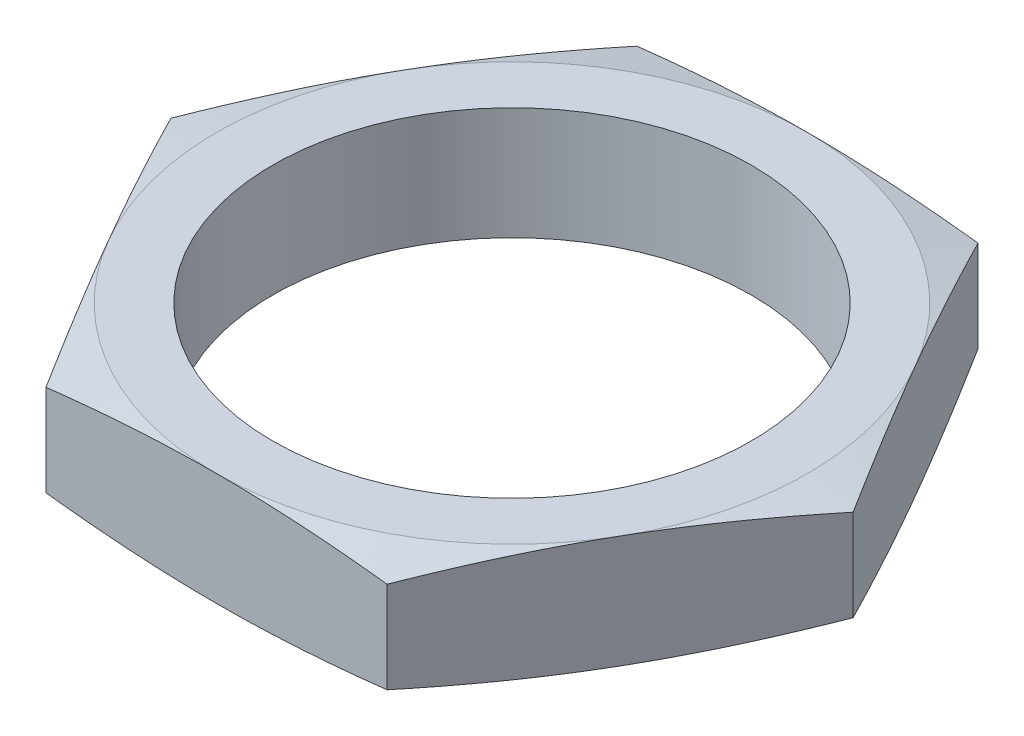
ISO-10303-21;
HEADER;
FILE_DESCRIPTION(('STEP AP214'),'2;1');
FILE_NAME('part.step','',(''),(''),'','','');
FILE_SCHEMA(('AUTOMOTIVE_DESIGN { 1 0 10303 214 1 1 1 1 }'));
ENDSEC;
DATA;
#1=APPLICATION_CONTEXT('core data for automotive mechanical design processes');
#2=APPLICATION_PROTOCOL_DEFINITION('international standard','automotive_design',2000,#1);
#3=PRODUCT_CONTEXT('',#1,'mechanical');
#4=PRODUCT('Part','Part','',(#3));
#5=PRODUCT_RELATED_PRODUCT_CATEGORY('part','',(#4));
#6=PRODUCT_DEFINITION_FORMATION('','',#4);
#7=PRODUCT_DEFINITION_CONTEXT('part definition',#1,'design');
#8=PRODUCT_DEFINITION('design','',#6,#7);
#9=PRODUCT_DEFINITION_SHAPE('','',#8);
#10=(LENGTH_UNIT() NAMED_UNIT(*) SI_UNIT(.MILLI.,.METRE.));
#11=(NAMED_UNIT(*) PLANE_ANGLE_UNIT() SI_UNIT($,.RADIAN.));
#12=(NAMED_UNIT(*) SI_UNIT($,.STERADIAN.) SOLID_ANGLE_UNIT());
#13=UNCERTAINTY_MEASURE_WITH_UNIT(LENGTH_MEASURE(1.E-05),#10,'distance_accuracy_value','');
#14=(GEOMETRIC_REPRESENTATION_CONTEXT(3) GLOBAL_UNCERTAINTY_ASSIGNED_CONTEXT((#13)) GLOBAL_UNIT_ASSIGNED_CONTEXT((#10,
#11,#12)) REPRESENTATION_CONTEXT('',''));
#15=CARTESIAN_POINT('',(0.,0.,0.));
#16=DIRECTION('',(0.,0.,1.));
#17=DIRECTION('',(1.,0.,0.));
#18=AXIS2_PLACEMENT_3D('',#15,#16,#17);
#19=CARTESIAN_POINT('',(6.06217782649107,4.,10.5));
#20=DIRECTION('',(-0.866025403784439,0.,-0.5));
#21=DIRECTION('',(-0.5,0.,0.866025403784439));
#22=AXIS2_PLACEMENT_3D('',#19,#20,#21);
#23=PLANE('',#22);
#24=CARTESIAN_POINT('',(12.124471123036,0.375038710091855,-0.000200000000003287));
#25=CARTESIAN_POINT('',(11.8724989067043,0.316841888937931,0.436228680782173));
#26=CARTESIAN_POINT('',(11.6201860460254,0.264041816028018,0.873247374881132));
#27=CARTESIAN_POINT('',(11.1148984011924,0.171316417791879,1.7484312481686));
#28=CARTESIAN_POINT('',(10.8619234426667,0.131394921849064,2.18659672937783));
#29=CARTESIAN_POINT('',(10.3564530180006,0.0666694911329807,3.06209718662287));
#30=CARTESIAN_POINT('',(10.1039594400735,0.0418081017252033,3.49942889217747));
#31=CARTESIAN_POINT('',(9.59873279539913,0.00847451473004502,4.37450711009106));
#32=CARTESIAN_POINT('',(9.34599976756787,0.,4.81225355504553));
#33=CARTESIAN_POINT('',(8.84053371190534,0.,5.68774644495447));
#34=CARTESIAN_POINT('',(8.58780068407407,0.00847451473004509,6.12549288990895));
#35=CARTESIAN_POINT('',(8.08257403939968,0.0418081017252037,7.00057110782253));
#36=CARTESIAN_POINT('',(7.83008046147258,0.0666694911329814,7.43790281337713));
#37=CARTESIAN_POINT('',(7.32461003680651,0.131394921849065,8.31340327062217));
#38=CARTESIAN_POINT('',(7.07163507828076,0.17131641779188,8.7515687518314));
#39=CARTESIAN_POINT('',(6.56634743344782,0.264041816028019,9.62675262511887));
#40=CARTESIAN_POINT('',(6.31403457276889,0.316841888937933,10.0637713192178));
#41=CARTESIAN_POINT('',(6.06206235643723,0.375038710091857,10.5002));
#42=B_SPLINE_CURVE_WITH_KNOTS('',3,(#24,#25,#26,#27,#28,#29,#30,#31,#32,#33,#34,#35,#36,#37,#38,
#39,#40,#41),.UNSPECIFIED.,.F.,.F.,(4,2,2,2,2,2,2,2,4),(0.,1.52193893076381,3.04432998658017,
4.56087589681654,6.07720734820422,7.59353879959189,9.11008470982826,10.6324757656446,
12.1544146964084),.UNSPECIFIED.);
#43=CARTESIAN_POINT('',(12.1243556529821,0.375012051348566,0.));
#44=VERTEX_POINT('',#43);
#45=CARTESIAN_POINT('',(9.09326673973661,0.,5.25));
#46=VERTEX_POINT('',#45);
#47=EDGE_CURVE('E49',#44,#46,#42,.T.);
#48=ORIENTED_EDGE('',*,*,#47,.F.);
#49=DIRECTION('',(0.,-1.,0.));
#50=VECTOR('',#49,1.);
#51=CARTESIAN_POINT('',(12.1243556529821,4.,0.));
#52=LINE('',#51,#50);
#53=CARTESIAN_POINT('',(12.1243556529821,3.62498794865143,0.));
#54=VERTEX_POINT('',#53);
#55=EDGE_CURVE('E165',#54,#44,#52,.T.);
#56=ORIENTED_EDGE('',*,*,#55,.F.);
#57=CARTESIAN_POINT('',(6.06206235643723,3.62496128990814,10.5002));
#58=CARTESIAN_POINT('',(6.31403457276889,3.68315811106207,10.0637713192178));
#59=CARTESIAN_POINT('',(6.56634743344783,3.73595818397198,9.62675262511887));
#60=CARTESIAN_POINT('',(7.07163507828076,3.82868358220812,8.7515687518314));
#61=CARTESIAN_POINT('',(7.32461003680651,3.86860507815093,8.31340327062217));
#62=CARTESIAN_POINT('',(7.83008046147258,3.93333050886702,7.43790281337713));
#63=CARTESIAN_POINT('',(8.08257403939968,3.9581918982748,7.00057110782253));
#64=CARTESIAN_POINT('',(8.58780068407407,3.99152548526995,6.12549288990895));
#65=CARTESIAN_POINT('',(8.84053371190534,4.,5.68774644495447));
#66=CARTESIAN_POINT('',(9.34599976756787,4.,4.81225355504553));
#67=CARTESIAN_POINT('',(9.59873279539913,3.99152548526995,4.37450711009106));
#68=CARTESIAN_POINT('',(10.1039594400735,3.9581918982748,3.49942889217747));
#69=CARTESIAN_POINT('',(10.3564530180006,3.93333050886702,3.06209718662287));
#70=CARTESIAN_POINT('',(10.8619234426667,3.86860507815094,2.18659672937783));
#71=CARTESIAN_POINT('',(11.1148984011924,3.82868358220812,1.7484312481686));
#72=CARTESIAN_POINT('',(11.6201860460254,3.73595818397198,0.873247374881133));
#73=CARTESIAN_POINT('',(11.8724989067043,3.68315811106207,0.436228680782172));
#74=CARTESIAN_POINT('',(12.124471123036,3.62496128990814,-0.000200000000005463));
#75=B_SPLINE_CURVE_WITH_KNOTS('',3,(#57,#58,#59,#60,#61,#62,#63,#64,#65,#66,#67,#68,#69,#70,#71,
#72,#73,#74),.UNSPECIFIED.,.F.,.F.,(4,2,2,2,2,2,2,2,4),(0.,1.52193893076381,3.04432998658017,
4.56087589681654,6.07720734820422,7.59353879959189,9.11008470982826,10.6324757656446,
12.1544146964084),.UNSPECIFIED.);
#76=CARTESIAN_POINT('',(9.0932667397366,4.,5.25));
#77=VERTEX_POINT('',#76);
#78=EDGE_CURVE('E191',#77,#54,#75,.T.);
#79=ORIENTED_EDGE('',*,*,#78,.F.);
#80=CARTESIAN_POINT('',(6.06217782649107,3.62498794865143,10.5));
#81=VERTEX_POINT('',#80);
#82=EDGE_CURVE('E318',#81,#77,#75,.T.);
#83=ORIENTED_EDGE('',*,*,#82,.F.);
#84=DIRECTION('',(0.,-1.,0.));
#85=VECTOR('',#84,1.);
#86=CARTESIAN_POINT('',(6.06217782649107,4.,10.5));
#87=LINE('',#86,#85);
#88=CARTESIAN_POINT('',(6.06217782649107,0.375012051348568,10.5));
#89=VERTEX_POINT('',#88);
#90=EDGE_CURVE('E151',#81,#89,#87,.T.);
#91=ORIENTED_EDGE('',*,*,#90,.T.);
#92=EDGE_CURVE('E144',#46,#89,#42,.T.);
#93=ORIENTED_EDGE('',*,*,#92,.F.);
#94=EDGE_LOOP('',(#48,#56,#79,#83,#91,#93));
#95=FACE_BOUND('',#94,.T.);
#96=ADVANCED_FACE('F33',(#95),#23,.F.);
#97=CARTESIAN_POINT('',(12.1243556529821,4.,0.));
#98=DIRECTION('',(-0.866025403784439,0.,0.5));
#99=DIRECTION('',(0.5,0.,0.866025403784439));
#100=AXIS2_PLACEMENT_3D('',#97,#98,#99);
#101=PLANE('',#100);
#102=CARTESIAN_POINT('',(6.06206235643723,0.375038710091857,-10.5002));
#103=CARTESIAN_POINT('',(6.31403457276889,0.316841888937933,-10.0637713192178));
#104=CARTESIAN_POINT('',(6.56634743344782,0.264041816028019,-9.62675262511887));
#105=CARTESIAN_POINT('',(7.07163507828076,0.17131641779188,-8.7515687518314));
#106=CARTESIAN_POINT('',(7.32461003680651,0.131394921849065,-8.31340327062217));
#107=CARTESIAN_POINT('',(7.83008046147258,0.0666694911329814,-7.43790281337713));
#108=CARTESIAN_POINT('',(8.08257403939968,0.041808101725204,-7.00057110782253));
#109=CARTESIAN_POINT('',(8.58780068407407,0.00847451473004552,-6.12549288990895));
#110=CARTESIAN_POINT('',(8.84053371190534,0.,-5.68774644495448));
#111=CARTESIAN_POINT('',(9.34599976756787,0.,-4.81225355504553));
#112=CARTESIAN_POINT('',(9.59873279539913,0.00847451473004533,-4.37450711009106));
#113=CARTESIAN_POINT('',(10.1039594400735,0.0418081017252036,-3.49942889217748));
#114=CARTESIAN_POINT('',(10.3564530180006,0.0666694911329808,-3.06209718662288));
#115=CARTESIAN_POINT('',(10.8619234426667,0.131394921849064,-2.18659672937783));
#116=CARTESIAN_POINT('',(11.1148984011924,0.171316417791879,-1.74843124816861));
#117=CARTESIAN_POINT('',(11.6201860460254,0.264041816028018,-0.873247374881138));
#118=CARTESIAN_POINT('',(11.8724989067043,0.316841888937931,-0.436228680782177));
#119=CARTESIAN_POINT('',(12.124471123036,0.375038710091855,0.000199999999998464));
#120=B_SPLINE_CURVE_WITH_KNOTS('',3,(#102,#103,#104,#105,#106,#107,#108,#109,#110,#111,#112,
#113,#114,#115,#116,#117,#118,#119),.UNSPECIFIED.,.F.,.F.,(4,2,2,2,2,2,2,2,4),(0.,
1.52193893076381,3.04432998658017,4.56087589681654,6.07720734820421,7.59353879959189,
9.11008470982826,10.6324757656446,12.1544146964084),.UNSPECIFIED.);
#121=CARTESIAN_POINT('',(6.06217782649107,0.375012051348568,-10.5));
#122=VERTEX_POINT('',#121);
#123=CARTESIAN_POINT('',(9.09326673973661,0.,-5.25));
#124=VERTEX_POINT('',#123);
#125=EDGE_CURVE('E56',#122,#124,#120,.T.);
#126=ORIENTED_EDGE('',*,*,#125,.F.);
#127=DIRECTION('',(0.,-1.,0.));
#128=VECTOR('',#127,1.);
#129=CARTESIAN_POINT('',(6.06217782649107,4.,-10.5));
#130=LINE('',#129,#128);
#131=CARTESIAN_POINT('',(6.06217782649107,3.62498794865143,-10.5));
#132=VERTEX_POINT('',#131);
#133=EDGE_CURVE('E162',#132,#122,#130,.T.);
#134=ORIENTED_EDGE('',*,*,#133,.F.);
#135=CARTESIAN_POINT('',(12.124471123036,3.62496128990814,0.000199999999996775));
#136=CARTESIAN_POINT('',(11.8724989067043,3.68315811106207,-0.436228680782181));
#137=CARTESIAN_POINT('',(11.6201860460254,3.73595818397198,-0.873247374881141));
#138=CARTESIAN_POINT('',(11.1148984011924,3.82868358220812,-1.74843124816861));
#139=CARTESIAN_POINT('',(10.8619234426667,3.86860507815094,-2.18659672937784));
#140=CARTESIAN_POINT('',(10.3564530180006,3.93333050886702,-3.06209718662288));
#141=CARTESIAN_POINT('',(10.1039594400735,3.9581918982748,-3.49942889217748));
#142=CARTESIAN_POINT('',(9.59873279539913,3.99152548526995,-4.37450711009106));
#143=CARTESIAN_POINT('',(9.34599976756787,4.,-4.81225355504553));
#144=CARTESIAN_POINT('',(8.84053371190533,4.,-5.68774644495448));
#145=CARTESIAN_POINT('',(8.58780068407407,3.99152548526995,-6.12549288990895));
#146=CARTESIAN_POINT('',(8.08257403939968,3.95819189827479,-7.00057110782253));
#147=CARTESIAN_POINT('',(7.83008046147258,3.93333050886702,-7.43790281337713));
#148=CARTESIAN_POINT('',(7.32461003680651,3.86860507815093,-8.31340327062217));
#149=CARTESIAN_POINT('',(7.07163507828076,3.82868358220812,-8.7515687518314));
#150=CARTESIAN_POINT('',(6.56634743344782,3.73595818397198,-9.62675262511887));
#151=CARTESIAN_POINT('',(6.31403457276889,3.68315811106207,-10.0637713192178));
#152=CARTESIAN_POINT('',(6.06206235643723,3.62496128990814,-10.5002));
#153=B_SPLINE_CURVE_WITH_KNOTS('',3,(#135,#136,#137,#138,#139,#140,#141,#142,#143,#144,#145,
#146,#147,#148,#149,#150,#151,#152),.UNSPECIFIED.,.F.,.F.,(4,2,2,2,2,2,2,2,4),(0.,
1.52193893076381,3.04432998658017,4.56087589681654,6.07720734820421,7.59353879959189,
9.11008470982826,10.6324757656446,12.1544146964084),.UNSPECIFIED.);
#154=CARTESIAN_POINT('',(9.0932667397366,4.,-5.25));
#155=VERTEX_POINT('',#154);
#156=EDGE_CURVE('E220',#155,#132,#153,.T.);
#157=ORIENTED_EDGE('',*,*,#156,.F.);
#158=EDGE_CURVE('E316',#54,#155,#153,.T.);
#159=ORIENTED_EDGE('',*,*,#158,.F.);
#160=ORIENTED_EDGE('',*,*,#55,.T.);
#161=EDGE_CURVE('E241',#124,#44,#120,.T.);
#162=ORIENTED_EDGE('',*,*,#161,.F.);
#163=EDGE_LOOP('',(#126,#134,#157,#159,#160,#162));
#164=FACE_BOUND('',#163,.T.);
#165=ADVANCED_FACE('F228',(#164),#101,.F.);
#166=CARTESIAN_POINT('',(6.06217782649107,4.,-10.5));
#167=DIRECTION('',(0.,0.,1.));
#168=DIRECTION('',(1.,0.,0.));
#169=AXIS2_PLACEMENT_3D('',#166,#167,#168);
#170=PLANE('',#169);
#171=CARTESIAN_POINT('',(-16.2466371343311,2.04187515521451,-10.5));
#172=CARTESIAN_POINT('',(-15.7675131443876,1.94899793660242,-10.5));
#173=CARTESIAN_POINT('',(-15.288167910323,1.85724226812233,-10.5));
#174=CARTESIAN_POINT('',(-14.3289270333188,1.67657467185462,-10.5));
#175=CARTESIAN_POINT('',(-13.8490313737509,1.58766283245538,-10.5));
#176=CARTESIAN_POINT('',(-12.888288556212,1.41323074983288,-10.5));
#177=CARTESIAN_POINT('',(-12.407440975413,1.32771282745212,-10.5));
#178=CARTESIAN_POINT('',(-11.4450073984572,1.16094054868653,-10.5));
#179=CARTESIAN_POINT('',(-10.9634214067909,1.07968616647894,-10.5));
#180=CARTESIAN_POINT('',(-10.0023298306602,0.92292849403781,-10.5));
#181=CARTESIAN_POINT('',(-9.52282950637869,0.847393106967713,-10.5));
#182=CARTESIAN_POINT('',(-8.56285972857042,0.702765717999945,-10.5));
#183=CARTESIAN_POINT('',(-8.08239029054423,0.633673613866191,-10.5));
#184=CARTESIAN_POINT('',(-7.12039491812431,0.503437062967873,-10.5));
#185=CARTESIAN_POINT('',(-6.63886904694564,0.442292153173562,-10.5));
#186=CARTESIAN_POINT('',(-5.67467247766544,0.329697737760834,-10.5));
#187=CARTESIAN_POINT('',(-5.19200177878774,0.278248238717723,-10.5));
#188=CARTESIAN_POINT('',(-4.2214778666045,0.186566771843328,-10.5));
#189=CARTESIAN_POINT('',(-3.73361524801734,0.14643295189217,-10.5));
#190=CARTESIAN_POINT('',(-2.75694855071754,0.0798547344575269,-10.5));
#191=CARTESIAN_POINT('',(-2.26814448724592,0.0534101171987781,-10.5));
#192=CARTESIAN_POINT('',(-1.29012191287892,0.0156945805447427,-10.5));
#193=CARTESIAN_POINT('',(-0.800903624012189,0.00441801607418053,-10.5));
#194=CARTESIAN_POINT('',(0.177642724623896,-0.0022832073525811,-10.5));
#195=CARTESIAN_POINT('',(0.666970784159084,0.00229210019156923,-10.5));
#196=CARTESIAN_POINT('',(1.64669250832014,0.0270440378039138,-10.5));
#197=CARTESIAN_POINT('',(2.13708496820574,0.047267410696281,-10.5));
#198=CARTESIAN_POINT('',(3.11705218473422,0.102175488716899,-10.5));
#199=CARTESIAN_POINT('',(3.60662692832638,0.136860422478062,-10.5));
#200=CARTESIAN_POINT('',(4.58494250482269,0.218933722754924,-10.5));
#201=CARTESIAN_POINT('',(5.07368279267144,0.266328486851151,-10.5));
#202=CARTESIAN_POINT('',(6.04999115251638,0.371832122913668,-10.5));
#203=CARTESIAN_POINT('',(6.53755922387083,0.429941000744176,-10.5));
#204=CARTESIAN_POINT('',(7.54267210369522,0.55896855922324,-10.5));
#205=CARTESIAN_POINT('',(8.06014163399172,0.630468507004395,-10.5));
#206=CARTESIAN_POINT('',(9.09392092230066,0.781454965960225,-10.5));
#207=CARTESIAN_POINT('',(9.61023064287822,0.860941731241626,-10.5));
#208=CARTESIAN_POINT('',(10.6418864234912,1.02627761738452,-10.5));
#209=CARTESIAN_POINT('',(11.1572323638138,1.1121274809491,-10.5));
#210=CARTESIAN_POINT('',(12.1870465777263,1.2888846463827,-10.5));
#211=CARTESIAN_POINT('',(12.7015148607355,1.37979189361734,-10.5));
#212=CARTESIAN_POINT('',(13.7298972877568,1.56568256512135,-10.5));
#213=CARTESIAN_POINT('',(14.243811176223,1.66066739865691,-10.5));
#214=CARTESIAN_POINT('',(15.2710240909733,1.85390208280138,-10.5));
#215=CARTESIAN_POINT('',(15.784323116072,1.95215193969404,-10.5));
#216=CARTESIAN_POINT('',(17.3233796483235,2.25082984399086,-10.5));
#217=CARTESIAN_POINT('',(18.3483715466702,2.45519997199496,-10.5));
#218=CARTESIAN_POINT('',(20.3878479539207,2.86917344749507,-10.5));
#219=CARTESIAN_POINT('',(21.4023451947027,3.07871449904517,-10.5));
#220=CARTESIAN_POINT('',(23.4303333094072,3.50270567866686,-10.5));
#221=CARTESIAN_POINT('',(24.4438241622745,3.71715590727888,-10.5));
#222=CARTESIAN_POINT('',(26.4687730058533,4.14933590350782,-10.5));
#223=CARTESIAN_POINT('',(27.4802319505408,4.36706121015045,-10.5));
#224=CARTESIAN_POINT('',(28.9969745910103,4.69562912026978,-10.5));
#225=CARTESIAN_POINT('',(29.5024734714031,4.80548005873822,-10.5));
#226=CARTESIAN_POINT('',(30.5133443380741,5.02576257623526,-10.5));
#227=CARTESIAN_POINT('',(31.0187163244434,5.13619415484624,-10.5));
#228=CARTESIAN_POINT('',(31.5240335026075,5.24687592476436,-10.5));
#229=B_SPLINE_CURVE_WITH_KNOTS('',3,(#171,#172,#173,#174,#175,#176,#177,#178,#179,#180,#181,
#182,#183,#184,#185,#186,#187,#188,#189,#190,#191,#192,#193,#194,#195,#196,#197,#198,#199,#200,
#201,#202,#203,#204,#205,#206,#207,#208,#209,#210,#211,#212,#213,#214,#215,#216,#217,#218,#219,
#220,#221,#222,#223,#224,#225,#226,#227,#228),.UNSPECIFIED.,.F.,.F.,(4,2,2,2,2,2,2,2,2,2,2,2,2,
2,2,2,2,2,2,2,2,2,2,2,2,2,2,2,4),(0.,1.46413331625818,2.92831209476415,4.39347544306817,
5.85862991636982,7.31483504819036,8.77101707035564,10.2271142124861,11.6832123421197,
13.1515766841455,14.6199174513748,16.0877115967125,17.555502640173,19.0276951750632,
20.4999109857557,21.9728692419019,23.4458283042533,25.0129071205759,26.5800358105097,
28.1473477051872,29.714642671648,31.2824837464295,32.8503278388011,35.9857874818973,
39.0935071027225,42.2012904269945,45.3051674695445,46.857058669849,48.408948754169),.UNSPECIFIED.);
#230=CARTESIAN_POINT('',(-6.06217782649107,0.375012051348568,-10.5));
#231=VERTEX_POINT('',#230);
#232=CARTESIAN_POINT('',(0.,0.,-10.5));
#233=VERTEX_POINT('',#232);
#234=EDGE_CURVE('E239',#231,#233,#229,.T.);
#235=ORIENTED_EDGE('',*,*,#234,.F.);
#236=DIRECTION('',(0.,-1.,0.));
#237=VECTOR('',#236,1.);
#238=CARTESIAN_POINT('',(-6.06217782649107,4.,-10.5));
#239=LINE('',#238,#237);
#240=CARTESIAN_POINT('',(-6.06217782649107,3.62498794865143,-10.5));
#241=VERTEX_POINT('',#240);
#242=EDGE_CURVE('E153',#241,#231,#239,.T.);
#243=ORIENTED_EDGE('',*,*,#242,.F.);
#244=CARTESIAN_POINT('',(-16.2466371343311,1.95812484478549,-10.5));
#245=CARTESIAN_POINT('',(-15.7675131443876,2.05100206339758,-10.5));
#246=CARTESIAN_POINT('',(-15.288167910323,2.14275773187767,-10.5));
#247=CARTESIAN_POINT('',(-14.3289270333188,2.32342532814538,-10.5));
#248=CARTESIAN_POINT('',(-13.8490313737509,2.41233716754462,-10.5));
#249=CARTESIAN_POINT('',(-12.888288556212,2.58676925016712,-10.5));
#250=CARTESIAN_POINT('',(-12.407440975413,2.67228717254788,-10.5));
#251=CARTESIAN_POINT('',(-11.4450073984572,2.83905945131347,-10.5));
#252=CARTESIAN_POINT('',(-10.9634214067909,2.92031383352106,-10.5));
#253=CARTESIAN_POINT('',(-10.0023298306602,3.07707150596219,-10.5));
#254=CARTESIAN_POINT('',(-9.52282950637869,3.15260689303229,-10.5));
#255=CARTESIAN_POINT('',(-8.56285972857042,3.29723428200005,-10.5));
#256=CARTESIAN_POINT('',(-8.08239029054423,3.36632638613381,-10.5));
#257=CARTESIAN_POINT('',(-7.12039491812431,3.49656293703213,-10.5));
#258=CARTESIAN_POINT('',(-6.63886904694564,3.55770784682644,-10.5));
#259=CARTESIAN_POINT('',(-5.67467247766544,3.67030226223917,-10.5));
#260=CARTESIAN_POINT('',(-5.19200177878774,3.72175176128228,-10.5));
#261=CARTESIAN_POINT('',(-4.2214778666045,3.81343322815667,-10.5));
#262=CARTESIAN_POINT('',(-3.73361524801734,3.85356704810783,-10.5));
#263=CARTESIAN_POINT('',(-2.75694855071754,3.92014526554247,-10.5));
#264=CARTESIAN_POINT('',(-2.26814448724592,3.94658988280122,-10.5));
#265=CARTESIAN_POINT('',(-1.29012191287892,3.98430541945526,-10.5));
#266=CARTESIAN_POINT('',(-0.800903624012189,3.99558198392582,-10.5));
#267=CARTESIAN_POINT('',(0.177642724623896,4.00228320735258,-10.5));
#268=CARTESIAN_POINT('',(0.666970784159084,3.99770789980843,-10.5));
#269=CARTESIAN_POINT('',(1.64669250832014,3.97295596219609,-10.5));
#270=CARTESIAN_POINT('',(2.13708496820574,3.95273258930372,-10.5));
#271=CARTESIAN_POINT('',(3.11705218473422,3.8978245112831,-10.5));
#272=CARTESIAN_POINT('',(3.60662692832638,3.86313957752194,-10.5));
#273=CARTESIAN_POINT('',(4.58494250482269,3.78106627724507,-10.5));
#274=CARTESIAN_POINT('',(5.07368279267144,3.73367151314885,-10.5));
#275=CARTESIAN_POINT('',(6.04999115251638,3.62816787708633,-10.5));
#276=CARTESIAN_POINT('',(6.53755922387083,3.57005899925582,-10.5));
#277=CARTESIAN_POINT('',(7.54267210369522,3.44103144077676,-10.5));
#278=CARTESIAN_POINT('',(8.06014163399172,3.3695314929956,-10.5));
#279=CARTESIAN_POINT('',(9.09392092230066,3.21854503403977,-10.5));
#280=CARTESIAN_POINT('',(9.61023064287822,3.13905826875837,-10.5));
#281=CARTESIAN_POINT('',(10.6418864234912,2.97372238261548,-10.5));
#282=CARTESIAN_POINT('',(11.1572323638138,2.8878725190509,-10.5));
#283=CARTESIAN_POINT('',(12.1870465777263,2.7111153536173,-10.5));
#284=CARTESIAN_POINT('',(12.7015148607355,2.62020810638266,-10.5));
#285=CARTESIAN_POINT('',(13.7298972877568,2.43431743487865,-10.5));
#286=CARTESIAN_POINT('',(14.243811176223,2.33933260134309,-10.5));
#287=CARTESIAN_POINT('',(15.2710240909733,2.14609791719862,-10.5));
#288=CARTESIAN_POINT('',(15.784323116072,2.04784806030596,-10.5));
#289=CARTESIAN_POINT('',(17.3233796483235,1.74917015600914,-10.5));
#290=CARTESIAN_POINT('',(18.3483715466702,1.54480002800504,-10.5));
#291=CARTESIAN_POINT('',(20.3878479539207,1.13082655250493,-10.5));
#292=CARTESIAN_POINT('',(21.4023451947027,0.921285500954827,-10.5));
#293=CARTESIAN_POINT('',(23.4303333094072,0.497294321333138,-10.5));
#294=CARTESIAN_POINT('',(24.4438241622745,0.282844092721123,-10.5));
#295=CARTESIAN_POINT('',(26.4687730058533,-0.149335903507818,-10.5));
#296=CARTESIAN_POINT('',(27.4802319505408,-0.367061210150451,-10.5));
#297=CARTESIAN_POINT('',(28.9969745910103,-0.695629120269776,-10.5));
#298=CARTESIAN_POINT('',(29.5024734714031,-0.805480058738224,-10.5));
#299=CARTESIAN_POINT('',(30.5133443380741,-1.02576257623526,-10.5));
#300=CARTESIAN_POINT('',(31.0187163244434,-1.13619415484624,-10.5));
#301=CARTESIAN_POINT('',(31.5240335026075,-1.24687592476436,-10.5));
#302=B_SPLINE_CURVE_WITH_KNOTS('',3,(#244,#245,#246,#247,#248,#249,#250,#251,#252,#253,#254,
#255,#256,#257,#258,#259,#260,#261,#262,#263,#264,#265,#266,#267,#268,#269,#270,#271,#272,#273,
#274,#275,#276,#277,#278,#279,#280,#281,#282,#283,#284,#285,#286,#287,#288,#289,#290,#291,#292,
#293,#294,#295,#296,#297,#298,#299,#300,#301),.UNSPECIFIED.,.F.,.F.,(4,2,2,2,2,2,2,2,2,2,2,2,2,
2,2,2,2,2,2,2,2,2,2,2,2,2,2,2,4),(0.,1.46413331625818,2.92831209476415,4.39347544306817,
5.85862991636982,7.31483504819036,8.77101707035564,10.2271142124861,11.6832123421197,
13.1515766841455,14.6199174513748,16.0877115967125,17.555502640173,19.0276951750632,
20.4999109857557,21.9728692419019,23.4458283042533,25.0129071205759,26.5800358105097,
28.1473477051872,29.714642671648,31.2824837464295,32.8503278388011,35.9857874818973,
39.0935071027225,42.2012904269945,45.3051674695445,46.857058669849,48.408948754169),.UNSPECIFIED.);
#303=CARTESIAN_POINT('',(0.,4.,-10.5));
#304=VERTEX_POINT('',#303);
#305=EDGE_CURVE('E213',#304,#241,#302,.F.);
#306=ORIENTED_EDGE('',*,*,#305,.F.);
#307=EDGE_CURVE('E218',#132,#304,#302,.F.);
#308=ORIENTED_EDGE('',*,*,#307,.F.);
#309=ORIENTED_EDGE('',*,*,#133,.T.);
#310=EDGE_CURVE('E234',#233,#122,#229,.T.);
#311=ORIENTED_EDGE('',*,*,#310,.F.);
#312=EDGE_LOOP('',(#235,#243,#306,#308,#309,#311));
#313=FACE_BOUND('',#312,.T.);
#314=ADVANCED_FACE('F224',(#313),#170,.F.);
#315=CARTESIAN_POINT('',(-6.06217782649107,4.,-10.5));
#316=DIRECTION('',(0.866025403784439,0.,0.5));
#317=DIRECTION('',(0.5,0.,-0.866025403784439));
#318=AXIS2_PLACEMENT_3D('',#315,#316,#317);
#319=PLANE('',#318);
#320=CARTESIAN_POINT('',(-12.124471123036,0.375038710091857,0.000200000000000159));
#321=CARTESIAN_POINT('',(-11.8724989067043,0.316841888937933,-0.436228680782176));
#322=CARTESIAN_POINT('',(-11.6201860460254,0.26404181602802,-0.873247374881136));
#323=CARTESIAN_POINT('',(-11.1148984011924,0.17131641779188,-1.74843124816861));
#324=CARTESIAN_POINT('',(-10.8619234426667,0.131394921849065,-2.18659672937783));
#325=CARTESIAN_POINT('',(-10.3564530180006,0.0666694911329821,-3.06209718662288));
#326=CARTESIAN_POINT('',(-10.1039594400735,0.0418081017252046,-3.49942889217748));
#327=CARTESIAN_POINT('',(-9.59873279539914,0.00847451473004616,-4.37450711009106));
#328=CARTESIAN_POINT('',(-9.34599976756787,0.,-4.81225355504553));
#329=CARTESIAN_POINT('',(-8.84053371190534,0.,-5.68774644495447));
#330=CARTESIAN_POINT('',(-8.58780068407408,0.00847451473004615,-6.12549288990895));
#331=CARTESIAN_POINT('',(-8.08257403939969,0.0418081017252046,-7.00057110782253));
#332=CARTESIAN_POINT('',(-7.83008046147259,0.0666694911329822,-7.43790281337713));
#333=CARTESIAN_POINT('',(-7.32461003680652,0.131394921849066,-8.31340327062217));
#334=CARTESIAN_POINT('',(-7.07163507828077,0.171316417791881,-8.7515687518314));
#335=CARTESIAN_POINT('',(-6.56634743344783,0.26404181602802,-9.62675262511887));
#336=CARTESIAN_POINT('',(-6.3140345727689,0.316841888937933,-10.0637713192178));
#337=CARTESIAN_POINT('',(-6.06206235643723,0.375038710091857,-10.5002));
#338=B_SPLINE_CURVE_WITH_KNOTS('',3,(#320,#321,#322,#323,#324,#325,#326,#327,#328,#329,#330,
#331,#332,#333,#334,#335,#336,#337),.UNSPECIFIED.,.F.,.F.,(4,2,2,2,2,2,2,2,4),(0.,
1.52193893076381,3.04432998658017,4.56087589681654,6.07720734820421,7.59353879959189,
9.11008470982826,10.6324757656446,12.1544146964084),.UNSPECIFIED.);
#339=CARTESIAN_POINT('',(-12.1243556529821,0.375012051348567,0.));
#340=VERTEX_POINT('',#339);
#341=CARTESIAN_POINT('',(-9.09326673973661,0.,-5.25));
#342=VERTEX_POINT('',#341);
#343=EDGE_CURVE('E283',#340,#342,#338,.T.);
#344=ORIENTED_EDGE('',*,*,#343,.F.);
#345=DIRECTION('',(0.,-1.,0.));
#346=VECTOR('',#345,1.);
#347=CARTESIAN_POINT('',(-12.1243556529821,4.,0.));
#348=LINE('',#347,#346);
#349=CARTESIAN_POINT('',(-12.1243556529821,3.62498794865143,0.));
#350=VERTEX_POINT('',#349);
#351=EDGE_CURVE('E150',#350,#340,#348,.T.);
#352=ORIENTED_EDGE('',*,*,#351,.F.);
#353=CARTESIAN_POINT('',(-6.06206235643723,3.62496128990814,-10.5002));
#354=CARTESIAN_POINT('',(-6.3140345727689,3.68315811106207,-10.0637713192178));
#355=CARTESIAN_POINT('',(-6.56634743344783,3.73595818397198,-9.62675262511887));
#356=CARTESIAN_POINT('',(-7.07163507828077,3.82868358220812,-8.7515687518314));
#357=CARTESIAN_POINT('',(-7.32461003680652,3.86860507815093,-8.31340327062217));
#358=CARTESIAN_POINT('',(-7.83008046147258,3.93333050886702,-7.43790281337713));
#359=CARTESIAN_POINT('',(-8.08257403939969,3.95819189827479,-7.00057110782253));
#360=CARTESIAN_POINT('',(-8.58780068407408,3.99152548526995,-6.12549288990895));
#361=CARTESIAN_POINT('',(-8.84053371190534,4.,-5.68774644495447));
#362=CARTESIAN_POINT('',(-9.34599976756787,4.,-4.81225355504553));
#363=CARTESIAN_POINT('',(-9.59873279539914,3.99152548526995,-4.37450711009106));
#364=CARTESIAN_POINT('',(-10.1039594400735,3.95819189827479,-3.49942889217748));
#365=CARTESIAN_POINT('',(-10.3564530180006,3.93333050886702,-3.06209718662288));
#366=CARTESIAN_POINT('',(-10.8619234426667,3.86860507815093,-2.18659672937783));
#367=CARTESIAN_POINT('',(-11.1148984011924,3.82868358220812,-1.74843124816861));
#368=CARTESIAN_POINT('',(-11.6201860460254,3.73595818397198,-0.873247374881137));
#369=CARTESIAN_POINT('',(-11.8724989067043,3.68315811106207,-0.436228680782177));
#370=CARTESIAN_POINT('',(-12.124471123036,3.62496128990814,0.000200000000000827));
#371=B_SPLINE_CURVE_WITH_KNOTS('',3,(#353,#354,#355,#356,#357,#358,#359,#360,#361,#362,#363,
#364,#365,#366,#367,#368,#369,#370),.UNSPECIFIED.,.F.,.F.,(4,2,2,2,2,2,2,2,4),(0.,
1.52193893076381,3.04432998658017,4.56087589681654,6.07720734820421,7.59353879959189,
9.11008470982826,10.6324757656446,12.1544146964084),.UNSPECIFIED.);
#372=CARTESIAN_POINT('',(-9.09326673973661,4.,-5.25));
#373=VERTEX_POINT('',#372);
#374=EDGE_CURVE('E207',#373,#350,#371,.T.);
#375=ORIENTED_EDGE('',*,*,#374,.F.);
#376=EDGE_CURVE('E219',#241,#373,#371,.T.);
#377=ORIENTED_EDGE('',*,*,#376,.F.);
#378=ORIENTED_EDGE('',*,*,#242,.T.);
#379=EDGE_CURVE('E240',#342,#231,#338,.T.);
#380=ORIENTED_EDGE('',*,*,#379,.F.);
#381=EDGE_LOOP('',(#344,#352,#375,#377,#378,#380));
#382=FACE_BOUND('',#381,.T.);
#383=ADVANCED_FACE('F227',(#382),#319,.F.);
#384=CARTESIAN_POINT('',(-12.1243556529821,4.,0.));
#385=DIRECTION('',(0.866025403784439,0.,-0.5));
#386=DIRECTION('',(-0.5,0.,-0.866025403784439));
#387=AXIS2_PLACEMENT_3D('',#384,#385,#386);
#388=PLANE('',#387);
#389=CARTESIAN_POINT('',(-6.06206235643723,0.375038710091857,10.5002));
#390=CARTESIAN_POINT('',(-6.3140345727689,0.316841888937933,10.0637713192178));
#391=CARTESIAN_POINT('',(-6.56634743344783,0.26404181602802,9.62675262511887));
#392=CARTESIAN_POINT('',(-7.07163507828077,0.171316417791881,8.7515687518314));
#393=CARTESIAN_POINT('',(-7.32461003680652,0.131394921849066,8.31340327062217));
#394=CARTESIAN_POINT('',(-7.83008046147259,0.0666694911329822,7.43790281337713));
#395=CARTESIAN_POINT('',(-8.08257403939969,0.0418081017252047,7.00057110782253));
#396=CARTESIAN_POINT('',(-8.58780068407408,0.00847451473004627,6.12549288990895));
#397=CARTESIAN_POINT('',(-8.84053371190534,0.,5.68774644495447));
#398=CARTESIAN_POINT('',(-9.34599976756787,0.,4.81225355504553));
#399=CARTESIAN_POINT('',(-9.59873279539914,0.00847451473004644,4.37450711009106));
#400=CARTESIAN_POINT('',(-10.1039594400735,0.0418081017252049,3.49942889217747));
#401=CARTESIAN_POINT('',(-10.3564530180006,0.0666694911329823,3.06209718662288));
#402=CARTESIAN_POINT('',(-10.8619234426667,0.131394921849066,2.18659672937783));
#403=CARTESIAN_POINT('',(-11.1148984011924,0.171316417791881,1.74843124816861));
#404=CARTESIAN_POINT('',(-11.6201860460254,0.26404181602802,0.873247374881135));
#405=CARTESIAN_POINT('',(-11.8724989067043,0.316841888937933,0.436228680782174));
#406=CARTESIAN_POINT('',(-12.124471123036,0.375038710091857,-0.00020000000000162));
#407=B_SPLINE_CURVE_WITH_KNOTS('',3,(#389,#390,#391,#392,#393,#394,#395,#396,#397,#398,#399,
#400,#401,#402,#403,#404,#405,#406),.UNSPECIFIED.,.F.,.F.,(4,2,2,2,2,2,2,2,4),(0.,
1.52193893076381,3.04432998658017,4.56087589681654,6.07720734820421,7.59353879959189,
9.11008470982826,10.6324757656446,12.1544146964084),.UNSPECIFIED.);
#408=CARTESIAN_POINT('',(-6.06217782649107,0.375012051348567,10.5));
#409=VERTEX_POINT('',#408);
#410=CARTESIAN_POINT('',(-9.09326673973661,0.,5.25));
#411=VERTEX_POINT('',#410);
#412=EDGE_CURVE('E127',#409,#411,#407,.T.);
#413=ORIENTED_EDGE('',*,*,#412,.F.);
#414=DIRECTION('',(0.,-1.,0.));
#415=VECTOR('',#414,1.);
#416=CARTESIAN_POINT('',(-6.06217782649107,4.,10.5));
#417=LINE('',#416,#415);
#418=CARTESIAN_POINT('',(-6.06217782649107,3.62498794865143,10.5));
#419=VERTEX_POINT('',#418);
#420=EDGE_CURVE('E141',#419,#409,#417,.T.);
#421=ORIENTED_EDGE('',*,*,#420,.F.);
#422=CARTESIAN_POINT('',(-12.124471123036,3.62496128990814,-0.000199999999999909));
#423=CARTESIAN_POINT('',(-11.8724989067043,3.68315811106207,0.436228680782177));
#424=CARTESIAN_POINT('',(-11.6201860460254,3.73595818397198,0.873247374881138));
#425=CARTESIAN_POINT('',(-11.1148984011924,3.82868358220812,1.74843124816861));
#426=CARTESIAN_POINT('',(-10.8619234426667,3.86860507815093,2.18659672937783));
#427=CARTESIAN_POINT('',(-10.3564530180006,3.93333050886702,3.06209718662288));
#428=CARTESIAN_POINT('',(-10.1039594400735,3.95819189827479,3.49942889217748));
#429=CARTESIAN_POINT('',(-9.59873279539914,3.99152548526995,4.37450711009106));
#430=CARTESIAN_POINT('',(-9.34599976756787,4.,4.81225355504553));
#431=CARTESIAN_POINT('',(-8.84053371190534,4.,5.68774644495447));
#432=CARTESIAN_POINT('',(-8.58780068407408,3.99152548526995,6.12549288990895));
#433=CARTESIAN_POINT('',(-8.08257403939969,3.95819189827479,7.00057110782253));
#434=CARTESIAN_POINT('',(-7.83008046147258,3.93333050886702,7.43790281337713));
#435=CARTESIAN_POINT('',(-7.32461003680652,3.86860507815093,8.31340327062217));
#436=CARTESIAN_POINT('',(-7.07163507828077,3.82868358220812,8.7515687518314));
#437=CARTESIAN_POINT('',(-6.56634743344783,3.73595818397198,9.62675262511887));
#438=CARTESIAN_POINT('',(-6.3140345727689,3.68315811106207,10.0637713192178));
#439=CARTESIAN_POINT('',(-6.06206235643723,3.62496128990814,10.5002));
#440=B_SPLINE_CURVE_WITH_KNOTS('',3,(#422,#423,#424,#425,#426,#427,#428,#429,#430,#431,#432,
#433,#434,#435,#436,#437,#438,#439),.UNSPECIFIED.,.F.,.F.,(4,2,2,2,2,2,2,2,4),(0.,
1.52193893076381,3.04432998658017,4.56087589681654,6.07720734820421,7.59353879959189,
9.11008470982826,10.6324757656446,12.1544146964084),.UNSPECIFIED.);
#441=CARTESIAN_POINT('',(-9.09326673973661,4.,5.25));
#442=VERTEX_POINT('',#441);
#443=EDGE_CURVE('E201',#442,#419,#440,.T.);
#444=ORIENTED_EDGE('',*,*,#443,.F.);
#445=EDGE_CURVE('E254',#350,#442,#440,.T.);
#446=ORIENTED_EDGE('',*,*,#445,.F.);
#447=ORIENTED_EDGE('',*,*,#351,.T.);
#448=EDGE_CURVE('E143',#411,#340,#407,.T.);
#449=ORIENTED_EDGE('',*,*,#448,.F.);
#450=EDGE_LOOP('',(#413,#421,#444,#446,#447,#449));
#451=FACE_BOUND('',#450,.T.);
#452=ADVANCED_FACE('F139',(#451),#388,.F.);
#453=CARTESIAN_POINT('',(-6.06217782649107,4.,10.5));
#454=DIRECTION('',(0.,0.,-1.));
#455=DIRECTION('',(-1.,0.,0.));
#456=AXIS2_PLACEMENT_3D('',#453,#454,#455);
#457=PLANE('',#456);
#458=CARTESIAN_POINT('',(-16.2466371343311,2.04187515521451,10.5));
#459=CARTESIAN_POINT('',(-15.7675131443876,1.94899793660242,10.5));
#460=CARTESIAN_POINT('',(-15.288167910323,1.85724226812233,10.5));
#461=CARTESIAN_POINT('',(-14.3289270333188,1.67657467185462,10.5));
#462=CARTESIAN_POINT('',(-13.8490313737509,1.58766283245538,10.5));
#463=CARTESIAN_POINT('',(-12.888288556212,1.41323074983288,10.5));
#464=CARTESIAN_POINT('',(-12.407440975413,1.32771282745212,10.5));
#465=CARTESIAN_POINT('',(-11.4450073984572,1.16094054868653,10.5));
#466=CARTESIAN_POINT('',(-10.963421406791,1.07968616647894,10.5));
#467=CARTESIAN_POINT('',(-10.0023298306602,0.92292849403781,10.5));
#468=CARTESIAN_POINT('',(-9.52282950637869,0.847393106967713,10.5));
#469=CARTESIAN_POINT('',(-8.56285972857042,0.702765717999945,10.5));
#470=CARTESIAN_POINT('',(-8.08239029054423,0.633673613866191,10.5));
#471=CARTESIAN_POINT('',(-7.12039491812431,0.503437062967873,10.5));
#472=CARTESIAN_POINT('',(-6.63886904694564,0.442292153173562,10.5));
#473=CARTESIAN_POINT('',(-5.67467247766544,0.329697737760833,10.5));
#474=CARTESIAN_POINT('',(-5.19200177878774,0.278248238717722,10.5));
#475=CARTESIAN_POINT('',(-4.22147786660449,0.186566771843327,10.5));
#476=CARTESIAN_POINT('',(-3.73361524801734,0.14643295189217,10.5));
#477=CARTESIAN_POINT('',(-2.75694855071753,0.0798547344575268,10.5));
#478=CARTESIAN_POINT('',(-2.26814448724592,0.053410117198778,10.5));
#479=CARTESIAN_POINT('',(-1.29012191287892,0.0156945805447423,10.5));
#480=CARTESIAN_POINT('',(-0.800903624012185,0.00441801607417985,10.5));
#481=CARTESIAN_POINT('',(0.1776427246239,-0.00228320735258163,10.5));
#482=CARTESIAN_POINT('',(0.666970784159087,0.00229210019156905,10.5));
#483=CARTESIAN_POINT('',(1.64669250832015,0.0270440378039137,10.5));
#484=CARTESIAN_POINT('',(2.13708496820575,0.0472674106962807,10.5));
#485=CARTESIAN_POINT('',(3.11705218473422,0.102175488716899,10.5));
#486=CARTESIAN_POINT('',(3.60662692832638,0.136860422478063,10.5));
#487=CARTESIAN_POINT('',(4.58494250482269,0.218933722754924,10.5));
#488=CARTESIAN_POINT('',(5.07368279267144,0.266328486851151,10.5));
#489=CARTESIAN_POINT('',(6.04999115251638,0.371832122913668,10.5));
#490=CARTESIAN_POINT('',(6.53755922387083,0.429941000744176,10.5));
#491=CARTESIAN_POINT('',(7.54267210369521,0.55896855922324,10.5));
#492=CARTESIAN_POINT('',(8.06014163399172,0.630468507004395,10.5));
#493=CARTESIAN_POINT('',(9.09392092230065,0.781454965960224,10.5));
#494=CARTESIAN_POINT('',(9.61023064287821,0.860941731241625,10.5));
#495=CARTESIAN_POINT('',(10.6418864234912,1.02627761738452,10.5));
#496=CARTESIAN_POINT('',(11.1572323638138,1.1121274809491,10.5));
#497=CARTESIAN_POINT('',(12.1870465777263,1.2888846463827,10.5));
#498=CARTESIAN_POINT('',(12.7015148607355,1.37979189361734,10.5));
#499=CARTESIAN_POINT('',(13.7298972877568,1.56568256512135,10.5));
#500=CARTESIAN_POINT('',(14.243811176223,1.66066739865691,10.5));
#501=CARTESIAN_POINT('',(15.2710240909733,1.85390208280138,10.5));
#502=CARTESIAN_POINT('',(15.784323116072,1.95215193969404,10.5));
#503=CARTESIAN_POINT('',(17.3233796483235,2.25082984399085,10.5));
#504=CARTESIAN_POINT('',(18.3483715466702,2.45519997199496,10.5));
#505=CARTESIAN_POINT('',(20.3878479539207,2.86917344749506,10.5));
#506=CARTESIAN_POINT('',(21.4023451947027,3.07871449904517,10.5));
#507=CARTESIAN_POINT('',(23.4303333094072,3.50270567866686,10.5));
#508=CARTESIAN_POINT('',(24.4438241622745,3.71715590727887,10.5));
#509=CARTESIAN_POINT('',(26.4687730058533,4.14933590350782,10.5));
#510=CARTESIAN_POINT('',(27.4802319505408,4.36706121015045,10.5));
#511=CARTESIAN_POINT('',(28.9969745910103,4.69562912026978,10.5));
#512=CARTESIAN_POINT('',(29.5024734714031,4.80548005873822,10.5));
#513=CARTESIAN_POINT('',(30.5133443380741,5.02576257623526,10.5));
#514=CARTESIAN_POINT('',(31.0187163244434,5.13619415484624,10.5));
#515=CARTESIAN_POINT('',(31.5240335026075,5.24687592476436,10.5));
#516=B_SPLINE_CURVE_WITH_KNOTS('',3,(#458,#459,#460,#461,#462,#463,#464,#465,#466,#467,#468,
#469,#470,#471,#472,#473,#474,#475,#476,#477,#478,#479,#480,#481,#482,#483,#484,#485,#486,#487,
#488,#489,#490,#491,#492,#493,#494,#495,#496,#497,#498,#499,#500,#501,#502,#503,#504,#505,#506,
#507,#508,#509,#510,#511,#512,#513,#514,#515),.UNSPECIFIED.,.F.,.F.,(4,2,2,2,2,2,2,2,2,2,2,2,2,
2,2,2,2,2,2,2,2,2,2,2,2,2,2,2,4),(0.,1.46413331625818,2.92831209476415,4.39347544306817,
5.85862991636982,7.31483504819035,8.77101707035563,10.2271142124861,11.6832123421197,
13.1515766841455,14.6199174513748,16.0877115967125,17.555502640173,19.0276951750632,
20.4999109857557,21.9728692419019,23.4458283042533,25.0129071205759,26.5800358105096,
28.1473477051872,29.714642671648,31.2824837464295,32.8503278388011,35.9857874818973,
39.0935071027225,42.2012904269945,45.3051674695446,46.857058669849,48.408948754169),.UNSPECIFIED.);
#517=CARTESIAN_POINT('',(0.,0.,10.5));
#518=VERTEX_POINT('',#517);
#519=EDGE_CURVE('E133',#89,#518,#516,.F.);
#520=ORIENTED_EDGE('',*,*,#519,.F.);
#521=ORIENTED_EDGE('',*,*,#90,.F.);
#522=CARTESIAN_POINT('',(-16.2466371343311,1.95812484478549,10.5));
#523=CARTESIAN_POINT('',(-15.7675131443876,2.05100206339758,10.5));
#524=CARTESIAN_POINT('',(-15.288167910323,2.14275773187767,10.5));
#525=CARTESIAN_POINT('',(-14.3289270333188,2.32342532814538,10.5));
#526=CARTESIAN_POINT('',(-13.8490313737509,2.41233716754462,10.5));
#527=CARTESIAN_POINT('',(-12.888288556212,2.58676925016712,10.5));
#528=CARTESIAN_POINT('',(-12.407440975413,2.67228717254788,10.5));
#529=CARTESIAN_POINT('',(-11.4450073984572,2.83905945131347,10.5));
#530=CARTESIAN_POINT('',(-10.963421406791,2.92031383352106,10.5));
#531=CARTESIAN_POINT('',(-10.0023298306602,3.07707150596219,10.5));
#532=CARTESIAN_POINT('',(-9.52282950637869,3.15260689303229,10.5));
#533=CARTESIAN_POINT('',(-8.56285972857042,3.29723428200005,10.5));
#534=CARTESIAN_POINT('',(-8.08239029054423,3.36632638613381,10.5));
#535=CARTESIAN_POINT('',(-7.12039491812431,3.49656293703213,10.5));
#536=CARTESIAN_POINT('',(-6.63886904694564,3.55770784682644,10.5));
#537=CARTESIAN_POINT('',(-5.67467247766544,3.67030226223917,10.5));
#538=CARTESIAN_POINT('',(-5.19200177878774,3.72175176128228,10.5));
#539=CARTESIAN_POINT('',(-4.22147786660449,3.81343322815667,10.5));
#540=CARTESIAN_POINT('',(-3.73361524801734,3.85356704810783,10.5));
#541=CARTESIAN_POINT('',(-2.75694855071753,3.92014526554247,10.5));
#542=CARTESIAN_POINT('',(-2.26814448724592,3.94658988280122,10.5));
#543=CARTESIAN_POINT('',(-1.29012191287892,3.98430541945526,10.5));
#544=CARTESIAN_POINT('',(-0.800903624012185,3.99558198392582,10.5));
#545=CARTESIAN_POINT('',(0.1776427246239,4.00228320735258,10.5));
#546=CARTESIAN_POINT('',(0.666970784159087,3.99770789980843,10.5));
#547=CARTESIAN_POINT('',(1.64669250832015,3.97295596219609,10.5));
#548=CARTESIAN_POINT('',(2.13708496820575,3.95273258930372,10.5));
#549=CARTESIAN_POINT('',(3.11705218473422,3.8978245112831,10.5));
#550=CARTESIAN_POINT('',(3.60662692832638,3.86313957752194,10.5));
#551=CARTESIAN_POINT('',(4.58494250482269,3.78106627724507,10.5));
#552=CARTESIAN_POINT('',(5.07368279267144,3.73367151314885,10.5));
#553=CARTESIAN_POINT('',(6.04999115251638,3.62816787708633,10.5));
#554=CARTESIAN_POINT('',(6.53755922387083,3.57005899925582,10.5));
#555=CARTESIAN_POINT('',(7.54267210369521,3.44103144077676,10.5));
#556=CARTESIAN_POINT('',(8.06014163399172,3.3695314929956,10.5));
#557=CARTESIAN_POINT('',(9.09392092230065,3.21854503403978,10.5));
#558=CARTESIAN_POINT('',(9.61023064287821,3.13905826875837,10.5));
#559=CARTESIAN_POINT('',(10.6418864234912,2.97372238261548,10.5));
#560=CARTESIAN_POINT('',(11.1572323638138,2.8878725190509,10.5));
#561=CARTESIAN_POINT('',(12.1870465777263,2.7111153536173,10.5));
#562=CARTESIAN_POINT('',(12.7015148607355,2.62020810638266,10.5));
#563=CARTESIAN_POINT('',(13.7298972877568,2.43431743487865,10.5));
#564=CARTESIAN_POINT('',(14.243811176223,2.33933260134309,10.5));
#565=CARTESIAN_POINT('',(15.2710240909733,2.14609791719862,10.5));
#566=CARTESIAN_POINT('',(15.784323116072,2.04784806030596,10.5));
#567=CARTESIAN_POINT('',(17.3233796483235,1.74917015600915,10.5));
#568=CARTESIAN_POINT('',(18.3483715466702,1.54480002800504,10.5));
#569=CARTESIAN_POINT('',(20.3878479539207,1.13082655250493,10.5));
#570=CARTESIAN_POINT('',(21.4023451947027,0.921285500954827,10.5));
#571=CARTESIAN_POINT('',(23.4303333094072,0.497294321333139,10.5));
#572=CARTESIAN_POINT('',(24.4438241622745,0.282844092721126,10.5));
#573=CARTESIAN_POINT('',(26.4687730058533,-0.149335903507818,10.5));
#574=CARTESIAN_POINT('',(27.4802319505408,-0.367061210150453,10.5));
#575=CARTESIAN_POINT('',(28.9969745910103,-0.695629120269778,10.5));
#576=CARTESIAN_POINT('',(29.5024734714031,-0.805480058738226,10.5));
#577=CARTESIAN_POINT('',(30.5133443380741,-1.02576257623526,10.5));
#578=CARTESIAN_POINT('',(31.0187163244434,-1.13619415484624,10.5));
#579=CARTESIAN_POINT('',(31.5240335026075,-1.24687592476436,10.5));
#580=B_SPLINE_CURVE_WITH_KNOTS('',3,(#522,#523,#524,#525,#526,#527,#528,#529,#530,#531,#532,
#533,#534,#535,#536,#537,#538,#539,#540,#541,#542,#543,#544,#545,#546,#547,#548,#549,#550,#551,
#552,#553,#554,#555,#556,#557,#558,#559,#560,#561,#562,#563,#564,#565,#566,#567,#568,#569,#570,
#571,#572,#573,#574,#575,#576,#577,#578,#579),.UNSPECIFIED.,.F.,.F.,(4,2,2,2,2,2,2,2,2,2,2,2,2,
2,2,2,2,2,2,2,2,2,2,2,2,2,2,2,4),(0.,1.46413331625818,2.92831209476415,4.39347544306817,
5.85862991636982,7.31483504819035,8.77101707035563,10.2271142124861,11.6832123421197,
13.1515766841455,14.6199174513748,16.0877115967125,17.555502640173,19.0276951750632,
20.4999109857557,21.9728692419019,23.4458283042533,25.0129071205759,26.5800358105096,
28.1473477051872,29.714642671648,31.2824837464295,32.8503278388011,35.9857874818973,
39.0935071027225,42.2012904269945,45.3051674695446,46.857058669849,48.408948754169),.UNSPECIFIED.);
#581=CARTESIAN_POINT('',(0.,4.,10.5));
#582=VERTEX_POINT('',#581);
#583=EDGE_CURVE('E167',#582,#81,#580,.T.);
#584=ORIENTED_EDGE('',*,*,#583,.F.);
#585=EDGE_CURVE('E149',#419,#582,#580,.T.);
#586=ORIENTED_EDGE('',*,*,#585,.F.);
#587=ORIENTED_EDGE('',*,*,#420,.T.);
#588=EDGE_CURVE('E124',#518,#409,#516,.F.);
#589=ORIENTED_EDGE('',*,*,#588,.F.);
#590=EDGE_LOOP('',(#520,#521,#584,#586,#587,#589));
#591=FACE_BOUND('',#590,.T.);
#592=ADVANCED_FACE('F147',(#591),#457,.F.);
#593=CARTESIAN_POINT('',(12.1243556529821,0.,0.));
#594=DIRECTION('',(0.,1.,0.));
#595=DIRECTION('',(0.,0.,1.));
#596=AXIS2_PLACEMENT_3D('',#593,#594,#595);
#597=PLANE('',#596);
#598=CARTESIAN_POINT('',(0.,0.,0.));
#599=DIRECTION('',(0.,1.,0.));
#600=DIRECTION('',(0.,0.,1.));
#601=AXIS2_PLACEMENT_3D('',#598,#599,#600);
#602=CIRCLE('',#601,8.5);
#603=CARTESIAN_POINT('',(0.,0.,8.5));
#604=VERTEX_POINT('',#603);
#605=EDGE_CURVE('E330',#604,#604,#602,.T.);
#606=ORIENTED_EDGE('',*,*,#605,.T.);
#607=EDGE_LOOP('',(#606));
#608=FACE_BOUND('',#607,.T.);
#609=CARTESIAN_POINT('',(0.,0.,0.));
#610=DIRECTION('',(0.,1.,0.));
#611=DIRECTION('',(0.,0.,1.));
#612=AXIS2_PLACEMENT_3D('',#609,#610,#611);
#613=CIRCLE('',#612,10.5);
#614=EDGE_CURVE('E12',#518,#46,#613,.T.);
#615=ORIENTED_EDGE('',*,*,#614,.F.);
#616=EDGE_CURVE('E37',#411,#518,#613,.T.);
#617=ORIENTED_EDGE('',*,*,#616,.F.);
#618=EDGE_CURVE('E275',#342,#411,#613,.T.);
#619=ORIENTED_EDGE('',*,*,#618,.F.);
#620=EDGE_CURVE('E263',#233,#342,#613,.T.);
#621=ORIENTED_EDGE('',*,*,#620,.F.);
#622=CARTESIAN_POINT('',(0.,0.,0.));
#623=DIRECTION('',(0.,-1.,0.));
#624=DIRECTION('',(0.,0.,-1.));
#625=AXIS2_PLACEMENT_3D('',#622,#623,#624);
#626=CIRCLE('',#625,10.5);
#627=EDGE_CURVE('E134',#233,#124,#626,.T.);
#628=ORIENTED_EDGE('',*,*,#627,.T.);
#629=EDGE_CURVE('E42',#46,#124,#613,.T.);
#630=ORIENTED_EDGE('',*,*,#629,.F.);
#631=EDGE_LOOP('',(#615,#617,#619,#621,#628,#630));
#632=FACE_BOUND('',#631,.T.);
#633=ADVANCED_FACE('F274',(#608,#632),#597,.F.);
#634=CARTESIAN_POINT('',(12.1243556529821,4.,0.));
#635=DIRECTION('',(0.,1.,0.));
#636=DIRECTION('',(0.,0.,1.));
#637=AXIS2_PLACEMENT_3D('',#634,#635,#636);
#638=PLANE('',#637);
#639=CARTESIAN_POINT('',(0.,4.,0.));
#640=DIRECTION('',(0.,1.,0.));
#641=DIRECTION('',(0.,0.,1.));
#642=AXIS2_PLACEMENT_3D('',#639,#640,#641);
#643=CIRCLE('',#642,8.5);
#644=CARTESIAN_POINT('',(0.,4.,8.5));
#645=VERTEX_POINT('',#644);
#646=EDGE_CURVE('E156',#645,#645,#643,.T.);
#647=ORIENTED_EDGE('',*,*,#646,.F.);
#648=EDGE_LOOP('',(#647));
#649=FACE_BOUND('',#648,.T.);
#650=CARTESIAN_POINT('',(0.,4.,0.));
#651=DIRECTION('',(0.,1.,0.));
#652=DIRECTION('',(0.,0.,1.));
#653=AXIS2_PLACEMENT_3D('',#650,#651,#652);
#654=CIRCLE('',#653,10.5);
#655=EDGE_CURVE('E249',#442,#582,#654,.T.);
#656=ORIENTED_EDGE('',*,*,#655,.T.);
#657=EDGE_CURVE('E246',#582,#77,#654,.T.);
#658=ORIENTED_EDGE('',*,*,#657,.T.);
#659=EDGE_CURVE('E248',#77,#155,#654,.T.);
#660=ORIENTED_EDGE('',*,*,#659,.T.);
#661=EDGE_CURVE('E255',#155,#304,#654,.T.);
#662=ORIENTED_EDGE('',*,*,#661,.T.);
#663=EDGE_CURVE('E258',#304,#373,#654,.T.);
#664=ORIENTED_EDGE('',*,*,#663,.T.);
#665=EDGE_CURVE('E256',#373,#442,#654,.T.);
#666=ORIENTED_EDGE('',*,*,#665,.T.);
#667=EDGE_LOOP('',(#656,#658,#660,#662,#664,#666));
#668=FACE_BOUND('',#667,.T.);
#669=ADVANCED_FACE('F326',(#649,#668),#638,.T.);
#670=CARTESIAN_POINT('',(0.,4.,0.));
#671=DIRECTION('',(0.,-1.,0.));
#672=DIRECTION('',(0.,0.,-1.));
#673=AXIS2_PLACEMENT_3D('',#670,#671,#672);
#674=CYLINDRICAL_SURFACE('',#673,8.5);
#675=ORIENTED_EDGE('',*,*,#646,.T.);
#676=EDGE_LOOP('',(#675));
#677=FACE_BOUND('',#676,.T.);
#678=ORIENTED_EDGE('',*,*,#605,.F.);
#679=EDGE_LOOP('',(#678));
#680=FACE_BOUND('',#679,.T.);
#681=ADVANCED_FACE('F182',(#677,#680),#674,.F.);
#682=CARTESIAN_POINT('',(0.,4.,0.));
#683=DIRECTION('',(0.,-1.,0.));
#684=DIRECTION('',(0.,0.,1.));
#685=AXIS2_PLACEMENT_3D('',#682,#683,#684);
#686=CONICAL_SURFACE('',#685,10.5,1.34390352403564);
#687=ORIENTED_EDGE('',*,*,#82,.T.);
#688=ORIENTED_EDGE('',*,*,#657,.F.);
#689=ORIENTED_EDGE('',*,*,#583,.T.);
#690=EDGE_LOOP('',(#687,#688,#689));
#691=FACE_BOUND('',#690,.T.);
#692=ADVANCED_FACE('F176',(#691),#686,.T.);
#693=ORIENTED_EDGE('',*,*,#443,.T.);
#694=ORIENTED_EDGE('',*,*,#585,.T.);
#695=ORIENTED_EDGE('',*,*,#655,.F.);
#696=EDGE_LOOP('',(#693,#694,#695));
#697=FACE_BOUND('',#696,.T.);
#698=ADVANCED_FACE('F181',(#697),#686,.T.);
#699=ORIENTED_EDGE('',*,*,#374,.T.);
#700=ORIENTED_EDGE('',*,*,#445,.T.);
#701=ORIENTED_EDGE('',*,*,#665,.F.);
#702=EDGE_LOOP('',(#699,#700,#701));
#703=FACE_BOUND('',#702,.T.);
#704=ADVANCED_FACE('F403',(#703),#686,.T.);
#705=ORIENTED_EDGE('',*,*,#305,.T.);
#706=ORIENTED_EDGE('',*,*,#376,.T.);
#707=ORIENTED_EDGE('',*,*,#663,.F.);
#708=EDGE_LOOP('',(#705,#706,#707));
#709=FACE_BOUND('',#708,.T.);
#710=ADVANCED_FACE('F395',(#709),#686,.T.);
#711=ORIENTED_EDGE('',*,*,#156,.T.);
#712=ORIENTED_EDGE('',*,*,#307,.T.);
#713=ORIENTED_EDGE('',*,*,#661,.F.);
#714=EDGE_LOOP('',(#711,#712,#713));
#715=FACE_BOUND('',#714,.T.);
#716=ADVANCED_FACE('F320',(#715),#686,.T.);
#717=ORIENTED_EDGE('',*,*,#78,.T.);
#718=ORIENTED_EDGE('',*,*,#158,.T.);
#719=ORIENTED_EDGE('',*,*,#659,.F.);
#720=EDGE_LOOP('',(#717,#718,#719));
#721=FACE_BOUND('',#720,.T.);
#722=ADVANCED_FACE('F184',(#721),#686,.T.);
#723=CARTESIAN_POINT('',(0.,0.,0.));
#724=DIRECTION('',(0.,1.,0.));
#725=DIRECTION('',(0.,0.,-1.));
#726=AXIS2_PLACEMENT_3D('',#723,#724,#725);
#727=CONICAL_SURFACE('',#726,10.5,1.34390352403564);
#728=ORIENTED_EDGE('',*,*,#412,.T.);
#729=ORIENTED_EDGE('',*,*,#616,.T.);
#730=ORIENTED_EDGE('',*,*,#588,.T.);
#731=EDGE_LOOP('',(#728,#729,#730));
#732=FACE_BOUND('',#731,.T.);
#733=ADVANCED_FACE('F126',(#732),#727,.T.);
#734=ORIENTED_EDGE('',*,*,#343,.T.);
#735=ORIENTED_EDGE('',*,*,#618,.T.);
#736=ORIENTED_EDGE('',*,*,#448,.T.);
#737=EDGE_LOOP('',(#734,#735,#736));
#738=FACE_BOUND('',#737,.T.);
#739=ADVANCED_FACE('F442',(#738),#727,.T.);
#740=ORIENTED_EDGE('',*,*,#234,.T.);
#741=ORIENTED_EDGE('',*,*,#620,.T.);
#742=ORIENTED_EDGE('',*,*,#379,.T.);
#743=EDGE_LOOP('',(#740,#741,#742));
#744=FACE_BOUND('',#743,.T.);
#745=ADVANCED_FACE('F185',(#744),#727,.T.);
#746=ORIENTED_EDGE('',*,*,#310,.T.);
#747=ORIENTED_EDGE('',*,*,#125,.T.);
#748=ORIENTED_EDGE('',*,*,#627,.F.);
#749=EDGE_LOOP('',(#746,#747,#748));
#750=FACE_BOUND('',#749,.T.);
#751=ADVANCED_FACE('F269',(#750),#727,.T.);
#752=ORIENTED_EDGE('',*,*,#161,.T.);
#753=ORIENTED_EDGE('',*,*,#47,.T.);
#754=ORIENTED_EDGE('',*,*,#629,.T.);
#755=EDGE_LOOP('',(#752,#753,#754));
#756=FACE_BOUND('',#755,.T.);
#757=ADVANCED_FACE('F445',(#756),#727,.T.);
#758=ORIENTED_EDGE('',*,*,#92,.T.);
#759=ORIENTED_EDGE('',*,*,#519,.T.);
#760=ORIENTED_EDGE('',*,*,#614,.T.);
#761=EDGE_LOOP('',(#758,#759,#760));
#762=FACE_BOUND('',#761,.T.);
#763=ADVANCED_FACE('F444',(#762),#727,.T.);
#764=CLOSED_SHELL('',(#96,#165,#314,#383,#452,#592,#633,#669,#681,#692,#698,#704,#710,#716,#722,
#733,#739,#745,#751,#757,#763));
#765=MANIFOLD_SOLID_BREP('B2',#764);
#766=ADVANCED_BREP_SHAPE_REPRESENTATION('',(#18,#765),#14);
#767=SHAPE_DEFINITION_REPRESENTATION(#9,#766);
ENDSEC;
END-ISO-10303-21;
